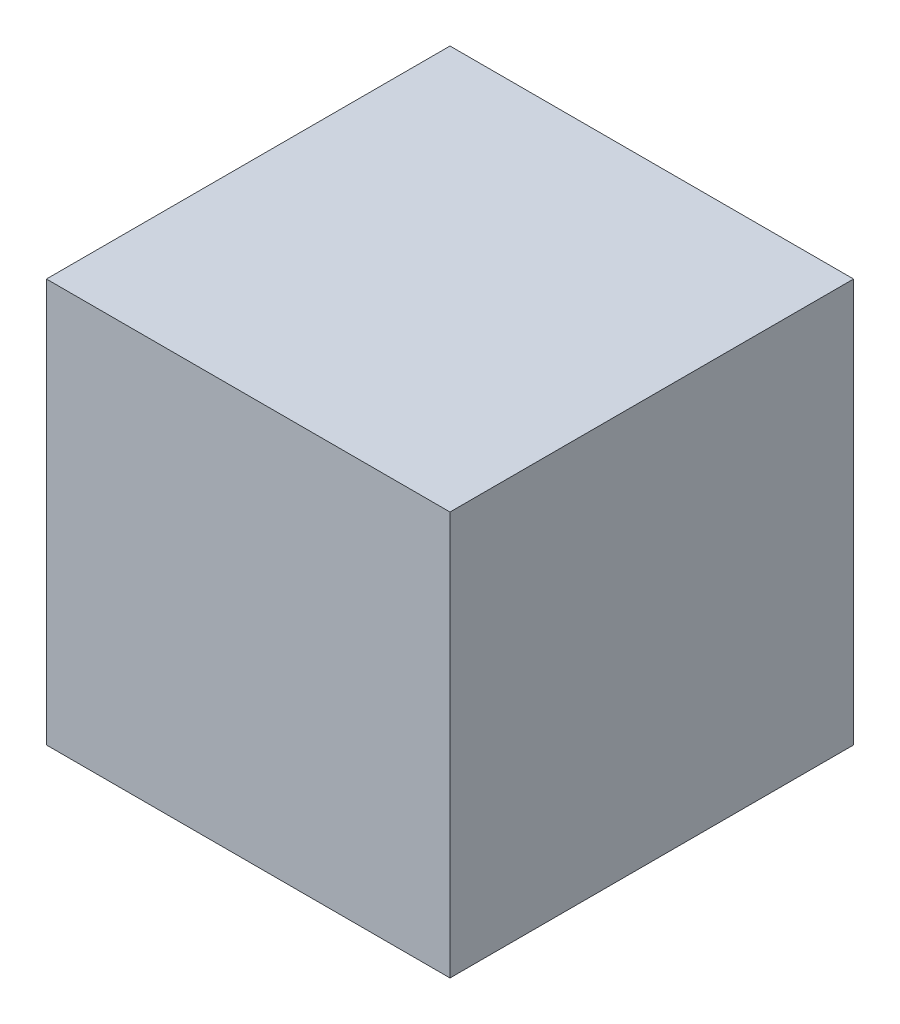
ISO-10303-21;
HEADER;
FILE_DESCRIPTION(('STEP AP214'),'2;1');
FILE_NAME('part.step','',(''),(''),'','','');
FILE_SCHEMA(('AUTOMOTIVE_DESIGN { 1 0 10303 214 1 1 1 1 }'));
ENDSEC;
DATA;
#1=APPLICATION_CONTEXT('core data for automotive mechanical design processes');
#2=APPLICATION_PROTOCOL_DEFINITION('international standard','automotive_design',2000,#1);
#3=PRODUCT_CONTEXT('',#1,'mechanical');
#4=PRODUCT('Part','Part','',(#3));
#5=PRODUCT_RELATED_PRODUCT_CATEGORY('part','',(#4));
#6=PRODUCT_DEFINITION_FORMATION('','',#4);
#7=PRODUCT_DEFINITION_CONTEXT('part definition',#1,'design');
#8=PRODUCT_DEFINITION('design','',#6,#7);
#9=PRODUCT_DEFINITION_SHAPE('','',#8);
#10=(LENGTH_UNIT() NAMED_UNIT(*) SI_UNIT(.MILLI.,.METRE.));
#11=(NAMED_UNIT(*) PLANE_ANGLE_UNIT() SI_UNIT($,.RADIAN.));
#12=(NAMED_UNIT(*) SI_UNIT($,.STERADIAN.) SOLID_ANGLE_UNIT());
#13=UNCERTAINTY_MEASURE_WITH_UNIT(LENGTH_MEASURE(1.E-05),#10,'distance_accuracy_value','');
#14=(GEOMETRIC_REPRESENTATION_CONTEXT(3) GLOBAL_UNCERTAINTY_ASSIGNED_CONTEXT((#13)) GLOBAL_UNIT_ASSIGNED_CONTEXT((#10,
#11,#12)) REPRESENTATION_CONTEXT('',''));
#15=CARTESIAN_POINT('',(0.,0.,0.));
#16=DIRECTION('',(0.,0.,1.));
#17=DIRECTION('',(1.,0.,0.));
#18=AXIS2_PLACEMENT_3D('',#15,#16,#17);
#19=CARTESIAN_POINT('',(-20.9485974355114,25.0353034979424,30.));
#20=DIRECTION('',(1.,0.,0.));
#21=DIRECTION('',(0.,1.,0.));
#22=AXIS2_PLACEMENT_3D('',#19,#20,#21);
#23=PLANE('',#22);
#24=DIRECTION('',(0.,-1.,0.));
#25=VECTOR('',#24,1.);
#26=CARTESIAN_POINT('',(-20.9485974355114,25.0353034979424,0.));
#27=LINE('',#26,#25);
#28=CARTESIAN_POINT('',(-20.9485974355114,25.0353034979424,0.));
#29=VERTEX_POINT('',#28);
#30=CARTESIAN_POINT('',(-20.9485974355114,-4.96469650205761,0.));
#31=VERTEX_POINT('',#30);
#32=EDGE_CURVE('E117',#29,#31,#27,.T.);
#33=ORIENTED_EDGE('',*,*,#32,.T.);
#34=DIRECTION('',(0.,0.,-1.));
#35=VECTOR('',#34,1.);
#36=CARTESIAN_POINT('',(-20.9485974355114,-4.96469650205761,30.));
#37=LINE('',#36,#35);
#38=CARTESIAN_POINT('',(-20.9485974355114,-4.96469650205761,30.));
#39=VERTEX_POINT('',#38);
#40=EDGE_CURVE('E11',#39,#31,#37,.T.);
#41=ORIENTED_EDGE('',*,*,#40,.F.);
#42=DIRECTION('',(0.,-1.,0.));
#43=VECTOR('',#42,1.);
#44=CARTESIAN_POINT('',(-20.9485974355114,25.0353034979424,30.));
#45=LINE('',#44,#43);
#46=CARTESIAN_POINT('',(-20.9485974355114,25.0353034979424,30.));
#47=VERTEX_POINT('',#46);
#48=EDGE_CURVE('E101',#47,#39,#45,.T.);
#49=ORIENTED_EDGE('',*,*,#48,.F.);
#50=DIRECTION('',(0.,0.,-1.));
#51=VECTOR('',#50,1.);
#52=CARTESIAN_POINT('',(-20.9485974355114,25.0353034979424,30.));
#53=LINE('',#52,#51);
#54=EDGE_CURVE('E113',#47,#29,#53,.T.);
#55=ORIENTED_EDGE('',*,*,#54,.T.);
#56=EDGE_LOOP('',(#33,#41,#49,#55));
#57=FACE_BOUND('',#56,.T.);
#58=ADVANCED_FACE('F49',(#57),#23,.F.);
#59=CARTESIAN_POINT('',(-20.9485974355114,-4.96469650205761,30.));
#60=DIRECTION('',(0.,1.,0.));
#61=DIRECTION('',(0.,0.,1.));
#62=AXIS2_PLACEMENT_3D('',#59,#60,#61);
#63=PLANE('',#62);
#64=DIRECTION('',(1.,0.,0.));
#65=VECTOR('',#64,1.);
#66=CARTESIAN_POINT('',(-20.9485974355114,-4.96469650205761,0.));
#67=LINE('',#66,#65);
#68=CARTESIAN_POINT('',(9.05140256448861,-4.96469650205761,0.));
#69=VERTEX_POINT('',#68);
#70=EDGE_CURVE('E106',#31,#69,#67,.T.);
#71=ORIENTED_EDGE('',*,*,#70,.T.);
#72=DIRECTION('',(0.,0.,-1.));
#73=VECTOR('',#72,1.);
#74=CARTESIAN_POINT('',(9.05140256448861,-4.96469650205761,30.));
#75=LINE('',#74,#73);
#76=CARTESIAN_POINT('',(9.05140256448861,-4.96469650205761,30.));
#77=VERTEX_POINT('',#76);
#78=EDGE_CURVE('E58',#77,#69,#75,.T.);
#79=ORIENTED_EDGE('',*,*,#78,.F.);
#80=DIRECTION('',(1.,0.,0.));
#81=VECTOR('',#80,1.);
#82=CARTESIAN_POINT('',(-20.9485974355114,-4.96469650205761,30.));
#83=LINE('',#82,#81);
#84=EDGE_CURVE('E96',#39,#77,#83,.T.);
#85=ORIENTED_EDGE('',*,*,#84,.F.);
#86=ORIENTED_EDGE('',*,*,#40,.T.);
#87=EDGE_LOOP('',(#71,#79,#85,#86));
#88=FACE_BOUND('',#87,.T.);
#89=ADVANCED_FACE('F105',(#88),#63,.F.);
#90=CARTESIAN_POINT('',(9.0514025644886,25.0353034979424,30.));
#91=DIRECTION('',(-1.,0.,0.));
#92=DIRECTION('',(0.,-1.,0.));
#93=AXIS2_PLACEMENT_3D('',#90,#91,#92);
#94=PLANE('',#93);
#95=DIRECTION('',(0.,1.,0.));
#96=VECTOR('',#95,1.);
#97=CARTESIAN_POINT('',(9.0514025644886,25.0353034979424,0.));
#98=LINE('',#97,#96);
#99=CARTESIAN_POINT('',(9.0514025644886,25.0353034979424,0.));
#100=VERTEX_POINT('',#99);
#101=EDGE_CURVE('E83',#69,#100,#98,.T.);
#102=ORIENTED_EDGE('',*,*,#101,.T.);
#103=DIRECTION('',(0.,0.,-1.));
#104=VECTOR('',#103,1.);
#105=CARTESIAN_POINT('',(9.0514025644886,25.0353034979424,30.));
#106=LINE('',#105,#104);
#107=CARTESIAN_POINT('',(9.0514025644886,25.0353034979424,30.));
#108=VERTEX_POINT('',#107);
#109=EDGE_CURVE('E108',#108,#100,#106,.T.);
#110=ORIENTED_EDGE('',*,*,#109,.F.);
#111=DIRECTION('',(0.,1.,0.));
#112=VECTOR('',#111,1.);
#113=CARTESIAN_POINT('',(9.0514025644886,25.0353034979424,30.));
#114=LINE('',#113,#112);
#115=EDGE_CURVE('E99',#77,#108,#114,.T.);
#116=ORIENTED_EDGE('',*,*,#115,.F.);
#117=ORIENTED_EDGE('',*,*,#78,.T.);
#118=EDGE_LOOP('',(#102,#110,#116,#117));
#119=FACE_BOUND('',#118,.T.);
#120=ADVANCED_FACE('F109',(#119),#94,.F.);
#121=CARTESIAN_POINT('',(-20.9485974355114,25.0353034979424,30.));
#122=DIRECTION('',(0.,-1.,0.));
#123=DIRECTION('',(0.,0.,-1.));
#124=AXIS2_PLACEMENT_3D('',#121,#122,#123);
#125=PLANE('',#124);
#126=DIRECTION('',(-1.,0.,0.));
#127=VECTOR('',#126,1.);
#128=CARTESIAN_POINT('',(-20.9485974355114,25.0353034979424,0.));
#129=LINE('',#128,#127);
#130=EDGE_CURVE('E89',#100,#29,#129,.T.);
#131=ORIENTED_EDGE('',*,*,#130,.T.);
#132=ORIENTED_EDGE('',*,*,#54,.F.);
#133=DIRECTION('',(-1.,0.,0.));
#134=VECTOR('',#133,1.);
#135=CARTESIAN_POINT('',(-20.9485974355114,25.0353034979424,30.));
#136=LINE('',#135,#134);
#137=EDGE_CURVE('E66',#108,#47,#136,.T.);
#138=ORIENTED_EDGE('',*,*,#137,.F.);
#139=ORIENTED_EDGE('',*,*,#109,.T.);
#140=EDGE_LOOP('',(#131,#132,#138,#139));
#141=FACE_BOUND('',#140,.T.);
#142=ADVANCED_FACE('F130',(#141),#125,.F.);
#143=CARTESIAN_POINT('',(0.,0.,30.));
#144=DIRECTION('',(0.,0.,1.));
#145=DIRECTION('',(1.,0.,0.));
#146=AXIS2_PLACEMENT_3D('',#143,#144,#145);
#147=PLANE('',#146);
#148=ORIENTED_EDGE('',*,*,#48,.T.);
#149=ORIENTED_EDGE('',*,*,#84,.T.);
#150=ORIENTED_EDGE('',*,*,#115,.T.);
#151=ORIENTED_EDGE('',*,*,#137,.T.);
#152=EDGE_LOOP('',(#148,#149,#150,#151));
#153=FACE_BOUND('',#152,.T.);
#154=ADVANCED_FACE('F97',(#153),#147,.T.);
#155=CARTESIAN_POINT('',(0.,0.,0.));
#156=DIRECTION('',(0.,0.,1.));
#157=DIRECTION('',(1.,0.,0.));
#158=AXIS2_PLACEMENT_3D('',#155,#156,#157);
#159=PLANE('',#158);
#160=ORIENTED_EDGE('',*,*,#32,.F.);
#161=ORIENTED_EDGE('',*,*,#130,.F.);
#162=ORIENTED_EDGE('',*,*,#101,.F.);
#163=ORIENTED_EDGE('',*,*,#70,.F.);
#164=EDGE_LOOP('',(#160,#161,#162,#163));
#165=FACE_BOUND('',#164,.T.);
#166=ADVANCED_FACE('F133',(#165),#159,.F.);
#167=CLOSED_SHELL('',(#58,#89,#120,#142,#154,#166));
#168=MANIFOLD_SOLID_BREP('B2',#167);
#169=ADVANCED_BREP_SHAPE_REPRESENTATION('',(#18,#168),#14);
#170=SHAPE_DEFINITION_REPRESENTATION(#9,#169);
ENDSEC;
END-ISO-10303-21;
